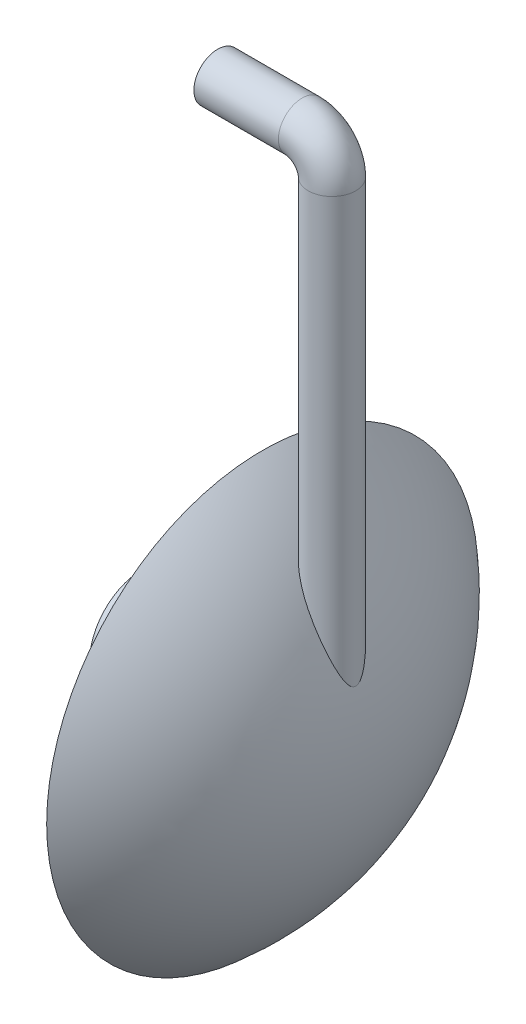
ISO-10303-21;
HEADER;
FILE_DESCRIPTION(('STEP AP214'),'2;1');
FILE_NAME('part.step','',(''),(''),'','','');
FILE_SCHEMA(('AUTOMOTIVE_DESIGN { 1 0 10303 214 1 1 1 1 }'));
ENDSEC;
DATA;
#1=APPLICATION_CONTEXT('core data for automotive mechanical design processes');
#2=APPLICATION_PROTOCOL_DEFINITION('international standard','automotive_design',2000,#1);
#3=PRODUCT_CONTEXT('',#1,'mechanical');
#4=PRODUCT('Part','Part','',(#3));
#5=PRODUCT_RELATED_PRODUCT_CATEGORY('part','',(#4));
#6=PRODUCT_DEFINITION_FORMATION('','',#4);
#7=PRODUCT_DEFINITION_CONTEXT('part definition',#1,'design');
#8=PRODUCT_DEFINITION('design','',#6,#7);
#9=PRODUCT_DEFINITION_SHAPE('','',#8);
#10=(LENGTH_UNIT() NAMED_UNIT(*) SI_UNIT(.MILLI.,.METRE.));
#11=(NAMED_UNIT(*) PLANE_ANGLE_UNIT() SI_UNIT($,.RADIAN.));
#12=(NAMED_UNIT(*) SI_UNIT($,.STERADIAN.) SOLID_ANGLE_UNIT());
#13=UNCERTAINTY_MEASURE_WITH_UNIT(LENGTH_MEASURE(1.E-05),#10,'distance_accuracy_value','');
#14=(GEOMETRIC_REPRESENTATION_CONTEXT(3) GLOBAL_UNCERTAINTY_ASSIGNED_CONTEXT((#13)) GLOBAL_UNIT_ASSIGNED_CONTEXT((#10,
#11,#12)) REPRESENTATION_CONTEXT('',''));
#15=CARTESIAN_POINT('',(0.,0.,0.));
#16=DIRECTION('',(0.,0.,1.));
#17=DIRECTION('',(1.,0.,0.));
#18=AXIS2_PLACEMENT_3D('',#15,#16,#17);
#19=CARTESIAN_POINT('',(-185.343786390025,0.,0.));
#20=DIRECTION('',(1.,0.,0.));
#21=DIRECTION('',(0.,0.,1.));
#22=AXIS2_PLACEMENT_3D('',#19,#20,#21);
#23=SPHERICAL_SURFACE('',#22,285.343786390025);
#24=CARTESIAN_POINT('',(0.,0.,0.));
#25=DIRECTION('',(1.,0.,0.));
#26=DIRECTION('',(0.,0.,-1.));
#27=AXIS2_PLACEMENT_3D('',#24,#25,#26);
#28=CIRCLE('',#27,216.953352769679);
#29=CARTESIAN_POINT('',(0.,0.,-216.953352769679));
#30=VERTEX_POINT('',#29);
#31=EDGE_CURVE('E61',#30,#30,#28,.T.);
#32=ORIENTED_EDGE('',*,*,#31,.T.);
#33=EDGE_LOOP('',(#32));
#34=FACE_BOUND('',#33,.T.);
#35=CARTESIAN_POINT('',(62.2636703985634,139.9998,22.6203398304166));
#36=CARTESIAN_POINT('',(61.9027263476033,140.658121206942,22.4968938305638));
#37=CARTESIAN_POINT('',(61.5406175922272,141.313921635277,22.3634070179453));
#38=CARTESIAN_POINT('',(60.8145731365812,142.619796144723,22.0751233894074));
#39=CARTESIAN_POINT('',(60.4506374883293,143.269870387443,21.9203271769609));
#40=CARTESIAN_POINT('',(59.7213577623748,144.563792849074,21.5879767054843));
#41=CARTESIAN_POINT('',(59.3560131343265,145.207638195836,21.4104124401147));
#42=CARTESIAN_POINT('',(58.6247792399603,146.487850025113,21.0310386957517));
#43=CARTESIAN_POINT('',(58.2588899784375,147.124216573039,20.8292294289841));
#44=CARTESIAN_POINT('',(57.5284368061105,148.386543108784,20.4002349878755));
#45=CARTESIAN_POINT('',(57.163872063309,149.012527343489,20.1731228269819));
#46=CARTESIAN_POINT('',(56.4360311013157,150.254559391187,19.6911113443718));
#47=CARTESIAN_POINT('',(56.0727549547583,150.870606650794,19.4362104812048));
#48=CARTESIAN_POINT('',(55.3490331106618,152.090548993624,18.8966485524759));
#49=CARTESIAN_POINT('',(54.9885854726526,152.694452952523,18.6120102407476));
#50=CARTESIAN_POINT('',(54.2718440424096,153.888357611285,18.0104020962776));
#51=CARTESIAN_POINT('',(53.9155494574985,154.478360987004,17.6934385497733));
#52=CARTESIAN_POINT('',(53.2445611383868,155.583304969259,17.0580556406698));
#53=CARTESIAN_POINT('',(52.9292905081036,156.099822477651,16.7429955457471));
#54=CARTESIAN_POINT('',(52.3053974392755,157.117054642396,16.0822288535739));
#55=CARTESIAN_POINT('',(51.996774544162,157.617770385124,15.7365243693854));
#56=CARTESIAN_POINT('',(51.3877776578471,158.601290994384,15.0113416115332));
#57=CARTESIAN_POINT('',(51.0874201598626,159.084060640729,14.6318014293539));
#58=CARTESIAN_POINT('',(50.4983222630698,160.026820369325,13.8369023309254));
#59=CARTESIAN_POINT('',(50.2095818934427,160.486810394355,13.4215433247102));
#60=CARTESIAN_POINT('',(49.6430081383043,161.385762524293,12.5458942118428));
#61=CARTESIAN_POINT('',(49.3654018795133,161.824308283958,12.085025996349));
#62=CARTESIAN_POINT('',(48.8302868123771,162.666478953893,11.1210472403951));
#63=CARTESIAN_POINT('',(48.5727829470182,163.070095277981,10.6179263731464));
#64=CARTESIAN_POINT('',(48.0846570544583,163.832642526297,9.5698118900984));
#65=CARTESIAN_POINT('',(47.8539370521912,164.191736662823,9.02498381725376));
#66=CARTESIAN_POINT('',(47.4253560196684,164.856899564422,7.89189096507701));
#67=CARTESIAN_POINT('',(47.2274632530662,165.163019555763,7.3036689421195));
#68=CARTESIAN_POINT('',(46.9477251911352,165.594782147632,6.34480856618702));
#69=CARTESIAN_POINT('',(46.8522574454987,165.741906022907,5.98769176866911));
#70=CARTESIAN_POINT('',(46.6763857518997,166.012634674426,5.26109821060694));
#71=CARTESIAN_POINT('',(46.5959766372437,166.136247517653,4.89162574082501));
#72=CARTESIAN_POINT('',(46.4517666780444,166.357744097707,4.1420817621577));
#73=CARTESIAN_POINT('',(46.3879564425447,166.455642383068,3.76201638165399));
#74=CARTESIAN_POINT('',(46.2782416340099,166.623860564999,2.99323893946723));
#75=CARTESIAN_POINT('',(46.2323375430637,166.694179719053,2.60452664528017));
#76=CARTESIAN_POINT('',(46.1593070405471,166.806011282779,1.81890848354996));
#77=CARTESIAN_POINT('',(46.1322899689683,166.84735595788,1.42196838359212));
#78=CARTESIAN_POINT('',(46.0981457573747,166.899602257516,0.625226792189353));
#79=CARTESIAN_POINT('',(46.091018463216,166.910504117979,0.225425322943854));
#80=CARTESIAN_POINT('',(46.0968388748351,166.901599655254,-0.573696849856603));
#81=CARTESIAN_POINT('',(46.1097871954694,166.881792391536,-0.973017538311811));
#82=CARTESIAN_POINT('',(46.1554252575168,166.811947486523,-1.7678467093707));
#83=CARTESIAN_POINT('',(46.1881145484165,166.761910535107,-2.16335527876239));
#84=CARTESIAN_POINT('',(46.2693506748254,166.637474377562,-2.91901388627132));
#85=CARTESIAN_POINT('',(46.3165734021,166.565108452891,-3.27964573032947));
#86=CARTESIAN_POINT('',(46.4263411877276,166.396749639285,-3.99291623349638));
#87=CARTESIAN_POINT('',(46.4888850345349,166.300758618544,-4.34555552222347));
#88=CARTESIAN_POINT('',(46.6281756557643,166.086749294119,-5.04125866998189));
#89=CARTESIAN_POINT('',(46.7049252693539,165.968726587137,-5.38432059907911));
#90=CARTESIAN_POINT('',(46.8713835260161,165.712431780668,-6.05959367673261));
#91=CARTESIAN_POINT('',(46.9610951977937,165.574154948511,-6.39180226700009));
#92=CARTESIAN_POINT('',(47.1966118595001,165.210623627223,-7.19610972506459));
#93=CARTESIAN_POINT('',(47.3491151479961,164.974803931419,-7.66150504807126));
#94=CARTESIAN_POINT('',(47.675308763602,164.469154927409,-8.56562762208775));
#95=CARTESIAN_POINT('',(47.8490076377835,164.199311897902,-9.00434400731707));
#96=CARTESIAN_POINT('',(48.2143841595208,163.63013469461,-9.85558015625186));
#97=CARTESIAN_POINT('',(48.4060963634344,163.330743779067,-10.2680469130206));
#98=CARTESIAN_POINT('',(48.8040931849174,162.707344997648,-11.0663009911573));
#99=CARTESIAN_POINT('',(49.0103778007832,162.383337134652,-11.4520883156444));
#100=CARTESIAN_POINT('',(49.5584191241633,161.519773139807,-12.4150488552601));
#101=CARTESIAN_POINT('',(49.9091824945431,160.964462402407,-12.9730205523554));
#102=CARTESIAN_POINT('',(50.6323729181717,159.813125716748,-14.0298205949206));
#103=CARTESIAN_POINT('',(51.004813010042,159.217075225014,-14.5286127840773));
#104=CARTESIAN_POINT('',(51.7657313753759,157.99204681174,-15.4728857502981));
#105=CARTESIAN_POINT('',(52.154235880807,157.363014545345,-15.9182742947841));
#106=CARTESIAN_POINT('',(52.9419923387504,156.079534317217,-16.759684553553));
#107=CARTESIAN_POINT('',(53.3412430478464,155.425089292085,-17.155711949686));
#108=CARTESIAN_POINT('',(54.0912269603407,154.187669718748,-17.8512031232611));
#109=CARTESIAN_POINT('',(54.4410226204185,153.607347921826,-18.1564445422492));
#110=CARTESIAN_POINT('',(55.1443518185261,152.433709886152,-18.7362760266065));
#111=CARTESIAN_POINT('',(55.4978858823838,151.840391806479,-19.0108617155669));
#112=CARTESIAN_POINT('',(56.2074285304726,150.642459054419,-19.53175166941));
#113=CARTESIAN_POINT('',(56.5634383878283,150.037838250898,-19.7780400344941));
#114=CARTESIAN_POINT('',(57.2765845925267,148.819212512366,-20.244177311825));
#115=CARTESIAN_POINT('',(57.6337208950701,148.20520794691,-20.4640272622691));
#116=CARTESIAN_POINT('',(58.348533926547,146.968494188952,-20.879293790349));
#117=CARTESIAN_POINT('',(58.7062108479702,146.345777359784,-21.0746872167181));
#118=CARTESIAN_POINT('',(59.4209918567909,145.093269399327,-21.4424036699371));
#119=CARTESIAN_POINT('',(59.7780959457422,144.463478287262,-21.614726759468));
#120=CARTESIAN_POINT('',(60.4910052624651,143.197843548346,-21.9377004043126));
#121=CARTESIAN_POINT('',(60.8468107645094,142.56200131579,-22.0883558292569));
#122=CARTESIAN_POINT('',(61.5566689397232,141.284849878801,-22.369317889194));
#123=CARTESIAN_POINT('',(61.9107215133293,140.64354036934,-22.4996233808963));
#124=CARTESIAN_POINT('',(62.9649337776355,138.720771887051,-22.860187663465));
#125=CARTESIAN_POINT('',(63.6618401808043,137.432147588998,-23.0621813097866));
#126=CARTESIAN_POINT('',(65.0439666539756,134.839765474641,-23.3981617761876));
#127=CARTESIAN_POINT('',(65.7291844683958,133.536004817212,-23.5321356105947));
#128=CARTESIAN_POINT('',(67.0862340992037,130.915388376321,-23.7384056265159));
#129=CARTESIAN_POINT('',(67.7580544595167,129.598522717299,-23.8106510620087));
#130=CARTESIAN_POINT('',(69.0859853693951,126.955186540181,-23.8984905608297));
#131=CARTESIAN_POINT('',(69.742096817663,125.628716577226,-23.9140878727119));
#132=CARTESIAN_POINT('',(71.0399596222494,122.962541262168,-23.8929270249512));
#133=CARTESIAN_POINT('',(71.6816415558885,121.622804001465,-23.8559552306917));
#134=CARTESIAN_POINT('',(72.9467850497911,118.937015080105,-23.7329084470534));
#135=CARTESIAN_POINT('',(73.5702463815941,117.590963340519,-23.6468328422604));
#136=CARTESIAN_POINT('',(74.7977498928706,114.894569633389,-23.4286269795393));
#137=CARTESIAN_POINT('',(75.4018013701018,113.544230071003,-23.296519142428));
#138=CARTESIAN_POINT('',(76.5900538351438,110.839823727039,-22.9886586980006));
#139=CARTESIAN_POINT('',(77.1742548310332,109.485756946977,-22.8129061084465));
#140=CARTESIAN_POINT('',(78.3627753388679,106.679131923491,-22.4057274520237));
#141=CARTESIAN_POINT('',(78.9655948544997,105.226381975027,-22.1712426573923));
#142=CARTESIAN_POINT('',(80.1470665542261,102.3192494564,-21.6560143051711));
#143=CARTESIAN_POINT('',(80.7257182616544,100.864866854615,-21.3752698357324));
#144=CARTESIAN_POINT('',(81.8586261264443,97.9548967970583,-20.7681717404017));
#145=CARTESIAN_POINT('',(82.4128653467668,96.4993091969782,-20.4417870855429));
#146=CARTESIAN_POINT('',(83.2251245671331,94.3171198513427,-19.9180906000943));
#147=CARTESIAN_POINT('',(83.4926908292437,93.5899320558294,-19.7378412304462));
#148=CARTESIAN_POINT('',(84.0214096559232,92.1361244538796,-19.3658229645488));
#149=CARTESIAN_POINT('',(84.2825618351224,91.4095046840981,-19.1740533785179));
#150=CARTESIAN_POINT('',(85.0532090080037,89.2395289636439,-18.5835732505331));
#151=CARTESIAN_POINT('',(85.5531228750231,87.7973814696918,-18.1676137140218));
#152=CARTESIAN_POINT('',(86.2831699002188,85.6387891033205,-17.5070394980842));
#153=CARTESIAN_POINT('',(86.5232161912483,84.9200259171355,-17.2807409506979));
#154=CARTESIAN_POINT('',(86.9966131671985,83.484445117633,-16.815348542997));
#155=CARTESIAN_POINT('',(87.2299640273289,82.7676274538493,-16.5762550179783));
#156=CARTESIAN_POINT('',(87.6896212447517,81.3371865064927,-16.0848050311613));
#157=CARTESIAN_POINT('',(87.9159346375585,80.623560686063,-15.8324625409372));
#158=CARTESIAN_POINT('',(88.361632294458,79.1994077786497,-15.3133303768516));
#159=CARTESIAN_POINT('',(88.5810166545839,78.4888806488374,-15.046540903358));
#160=CARTESIAN_POINT('',(89.0126327693542,77.0719347969192,-14.4973214368022));
#161=CARTESIAN_POINT('',(89.2248663980621,76.3655150391491,-14.214895593822));
#162=CARTESIAN_POINT('',(89.6420167758453,74.9577085435463,-13.6326836790159));
#163=CARTESIAN_POINT('',(89.846934014982,74.2563214711418,-13.3328987734629));
#164=CARTESIAN_POINT('',(90.1267577874575,73.284966033922,-12.9021325310698));
#165=CARTESIAN_POINT('',(90.2048882304192,73.0122275409681,-12.7794566788186));
#166=CARTESIAN_POINT('',(90.3599601221606,72.4678692554283,-12.5309237434637));
#167=CARTESIAN_POINT('',(90.4369015880638,72.1962494467728,-12.4050667062439));
#168=CARTESIAN_POINT('',(90.6659121497875,71.3832318427875,-12.0224413728677));
#169=CARTESIAN_POINT('',(90.8161652430444,70.8436833924406,-11.7606221783163));
#170=CARTESIAN_POINT('',(91.1120494528621,69.7690829891764,-11.2208288757854));
#171=CARTESIAN_POINT('',(91.2576638681057,69.2340514816725,-10.9428047902982));
#172=CARTESIAN_POINT('',(91.5433826177528,68.1721396817153,-10.3689923813664));
#173=CARTESIAN_POINT('',(91.6834875912082,67.6452584482204,-10.0732061283116));
#174=CARTESIAN_POINT('',(91.9610706349559,66.5893108997721,-9.45305537113048));
#175=CARTESIAN_POINT('',(92.0983982441994,66.060512307755,-9.12816529436819));
#176=CARTESIAN_POINT('',(92.3660012638125,65.0179143475384,-8.45135278290164));
#177=CARTESIAN_POINT('',(92.4962720891855,64.5041248287087,-8.09941312407834));
#178=CARTESIAN_POINT('',(92.6849316371785,63.7514449346592,-7.54730606780771));
#179=CARTESIAN_POINT('',(92.746553892952,63.5041242817743,-7.35971621851399));
#180=CARTESIAN_POINT('',(92.867408834903,63.0163034519463,-6.97516024551367));
#181=CARTESIAN_POINT('',(92.9266418677921,62.7758022869102,-6.7781954913535));
#182=CARTESIAN_POINT('',(93.0423203384712,62.3034965199439,-6.37386870910625));
#183=CARTESIAN_POINT('',(93.0987690691745,62.0716817268945,-6.16651957743111));
#184=CARTESIAN_POINT('',(93.2084881682589,61.618677045815,-5.73978993240589));
#185=CARTESIAN_POINT('',(93.2617596498377,61.397483441847,-5.5204136852576));
#186=CARTESIAN_POINT('',(93.347278799531,61.0405750598909,-5.14382062447647));
#187=CARTESIAN_POINT('',(93.3805847330466,60.9010753509645,-4.99043643138807));
#188=CARTESIAN_POINT('',(93.4452781960762,60.629224942591,-4.67707824111384));
#189=CARTESIAN_POINT('',(93.4766657205057,60.496874262092,-4.51710422646392));
#190=CARTESIAN_POINT('',(93.5676145313459,60.112179969282,-4.02608664547797));
#191=CARTESIAN_POINT('',(93.6238924295332,59.8724852967844,-3.68424722051363));
#192=CARTESIAN_POINT('',(93.7251954577838,59.4388927688728,-2.96302008740866));
#193=CARTESIAN_POINT('',(93.7700468705826,59.2457041218997,-2.58316255141895));
#194=CARTESIAN_POINT('',(93.8244651838158,59.0105461487762,-1.9911317205688));
#195=CARTESIAN_POINT('',(93.8404506087175,58.9413120426774,-1.79032116459985));
#196=CARTESIAN_POINT('',(93.8675774236423,58.8236758732176,-1.3824284676455));
#197=CARTESIAN_POINT('',(93.8787213298679,58.7752629889202,-1.17534964436713));
#198=CARTESIAN_POINT('',(93.8994545953766,58.6851367636802,-0.662264972243405));
#199=CARTESIAN_POINT('',(93.9060801303659,58.6562749691765,-0.353733127146157));
#200=CARTESIAN_POINT('',(93.9072462052157,58.6511984027582,0.263712557983289));
#201=CARTESIAN_POINT('',(93.9017872092943,58.6749816085255,0.572626382886423));
#202=CARTESIAN_POINT('',(93.8794688860112,58.7720237037015,1.18061211147604));
#203=CARTESIAN_POINT('',(93.8626571388684,58.8450761006886,1.47971964996072));
#204=CARTESIAN_POINT('',(93.8192823466902,59.0329904429555,2.06357349196985));
#205=CARTESIAN_POINT('',(93.7927114879452,59.1478858895787,2.34830807931918));
#206=CARTESIAN_POINT('',(93.7105981688641,59.5015728718353,3.09181867465144));
#207=CARTESIAN_POINT('',(93.6477165656401,59.7711470401314,3.53509620675101));
#208=CARTESIAN_POINT('',(93.5420543158047,60.2203046911103,4.1650743201037));
#209=CARTESIAN_POINT('',(93.504852740357,60.3778713224286,4.36963971508009));
#210=CARTESIAN_POINT('',(93.4272489044372,60.7051758222815,4.76819997734427));
#211=CARTESIAN_POINT('',(93.3868473381836,60.8749110501598,4.96219712201969));
#212=CARTESIAN_POINT('',(93.2899483966688,61.2801975749676,5.40134186111938));
#213=CARTESIAN_POINT('',(93.2324503973366,61.5193724944327,5.64289588719687));
#214=CARTESIAN_POINT('',(93.1136008634971,62.0107112992659,6.1114995265453));
#215=CARTESIAN_POINT('',(93.0522477385267,62.2628805377235,6.33854307444485));
#216=CARTESIAN_POINT('',(92.9262062004661,62.7776583698134,6.78030033747008));
#217=CARTESIAN_POINT('',(92.8615126356788,63.0402829358541,6.99499385881072));
#218=CARTESIAN_POINT('',(92.7293073715444,63.5735237108589,7.4133165929632));
#219=CARTESIAN_POINT('',(92.6617953520541,63.8441408266553,7.61694454277712));
#220=CARTESIAN_POINT('',(92.5239209183178,64.3932130289597,8.01550009058109));
#221=CARTESIAN_POINT('',(92.4535455089122,64.6717015522289,8.2103769475318));
#222=CARTESIAN_POINT('',(92.3105163664178,65.233980543888,8.5914397225809));
#223=CARTESIAN_POINT('',(92.2378625819226,65.5177711318483,8.77762544434749));
#224=CARTESIAN_POINT('',(92.0905362068164,66.0894539335299,9.14206595509149));
#225=CARTESIAN_POINT('',(92.0158657155109,66.3773417449056,9.32032851621266));
#226=CARTESIAN_POINT('',(91.8645789491961,66.956790786822,9.66990199949357));
#227=CARTESIAN_POINT('',(91.7879626758887,67.2483520141497,9.84121292773325));
#228=CARTESIAN_POINT('',(91.5757959988562,68.0504565190723,10.3014140578612));
#229=CARTESIAN_POINT('',(91.4383961944638,68.5641417263081,10.5839856976622));
#230=CARTESIAN_POINT('',(91.1584962323354,69.5987304640031,11.1329900265338));
#231=CARTESIAN_POINT('',(91.0159954364628,70.1196348925597,11.399420685056));
#232=CARTESIAN_POINT('',(90.7261477312257,71.1673032892379,11.918292812518));
#233=CARTESIAN_POINT('',(90.5787988294643,71.6940696060152,12.1707284126185));
#234=CARTESIAN_POINT('',(90.2795274203375,72.7521402227894,12.6631084850649));
#235=CARTESIAN_POINT('',(90.1276046792848,73.2834447536567,12.903052317464));
#236=CARTESIAN_POINT('',(89.819055802177,74.3507663622142,13.3721564480157));
#237=CARTESIAN_POINT('',(89.6624209924768,74.8867906601208,13.6012945783968));
#238=CARTESIAN_POINT('',(89.3448614376557,75.9618675528453,14.0492785874371));
#239=CARTESIAN_POINT('',(89.1839365669482,76.5009202359503,14.2681241642742));
#240=CARTESIAN_POINT('',(88.6949717175001,78.1215298829432,14.910349523127));
#241=CARTESIAN_POINT('',(88.3606550525098,79.2068376858999,15.3195482036767));
#242=CARTESIAN_POINT('',(87.675266615984,81.3864116159687,16.1055154937113));
#243=CARTESIAN_POINT('',(87.3241633550197,82.4806911118761,16.4822191142907));
#244=CARTESIAN_POINT('',(86.6062225086973,84.6741283049196,17.2053333970209));
#245=CARTESIAN_POINT('',(86.239384233708,85.7732862139692,17.5517427294132));
#246=CARTESIAN_POINT('',(85.4907457382116,87.9737147305728,18.2158561746517));
#247=CARTESIAN_POINT('',(85.1089622255378,89.0749817398199,18.5335910998381));
#248=CARTESIAN_POINT('',(84.330349496553,91.2796831827372,19.1419872544378));
#249=CARTESIAN_POINT('',(83.9335199204006,92.3831176676455,19.432647835766));
#250=CARTESIAN_POINT('',(82.9535166829483,95.0598198199715,20.1053464265812));
#251=CARTESIAN_POINT('',(82.3627348449652,96.6337356202198,20.4738113931539));
#252=CARTESIAN_POINT('',(81.1519180536867,99.7819063935222,21.1577076528501));
#253=CARTESIAN_POINT('',(80.5318815343303,101.356161380233,21.4731361026895));
#254=CARTESIAN_POINT('',(79.2628374828174,104.504355569139,22.0503216907508));
#255=CARTESIAN_POINT('',(78.6138072129983,106.078293515468,22.3120357719985));
#256=CARTESIAN_POINT('',(77.288113337478,109.222798069603,22.7795510463375));
#257=CARTESIAN_POINT('',(76.6114505776928,110.793364779066,22.9853539495689));
#258=CARTESIAN_POINT('',(75.2351573306658,113.921022050943,23.3372126303157));
#259=CARTESIAN_POINT('',(74.5356691819328,115.478139746892,23.4835823422445));
#260=CARTESIAN_POINT('',(73.1114333372859,118.585582358838,23.7143424219881));
#261=CARTESIAN_POINT('',(72.386684025424,120.135906833106,23.7987288171015));
#262=CARTESIAN_POINT('',(70.9141164349178,123.22602713752,23.9006107560571));
#263=CARTESIAN_POINT('',(70.1663205210488,124.765831507048,23.9181692107792));
#264=CARTESIAN_POINT('',(68.6489351116376,127.833564584555,23.8805615225812));
#265=CARTESIAN_POINT('',(67.8793502950386,129.361495753704,23.8254108790149));
#266=CARTESIAN_POINT('',(66.706290340909,131.650081154146,23.6820438822729));
#267=CARTESIAN_POINT('',(66.3100340665188,132.416390345752,23.6236807835395));
#268=CARTESIAN_POINT('',(65.5129512818093,133.944616531777,23.4853280190208));
#269=CARTESIAN_POINT('',(65.1121251513331,134.70653388343,23.4053401382989));
#270=CARTESIAN_POINT('',(64.3054497685619,136.227060220464,23.2222757043694));
#271=CARTESIAN_POINT('',(63.8995915281332,136.985658488351,23.119149595558));
#272=CARTESIAN_POINT('',(63.084215817873,138.497194192605,22.888469423222));
#273=CARTESIAN_POINT('',(62.6746982848198,139.250131530753,22.760914936867));
#274=CARTESIAN_POINT('',(62.2636703985634,139.9998,22.6203398304166));
#275=B_SPLINE_CURVE_WITH_KNOTS('',3,(#35,#36,#37,#38,#39,#40,#41,#42,#43,#44,#45,#46,#47,#48,
#49,#50,#51,#52,#53,#54,#55,#56,#57,#58,#59,#60,#61,#62,#63,#64,#65,#66,#67,#68,#69,#70,#71,#72,
#73,#74,#75,#76,#77,#78,#79,#80,#81,#82,#83,#84,#85,#86,#87,#88,#89,#90,#91,#92,#93,#94,#95,#96,
#97,#98,#99,#100,#101,#102,#103,#104,#105,#106,#107,#108,#109,#110,#111,#112,#113,#114,#115,
#116,#117,#118,#119,#120,#121,#122,#123,#124,#125,#126,#127,#128,#129,#130,#131,#132,#133,#134,
#135,#136,#137,#138,#139,#140,#141,#142,#143,#144,#145,#146,#147,#148,#149,#150,#151,#152,#153,
#154,#155,#156,#157,#158,#159,#160,#161,#162,#163,#164,#165,#166,#167,#168,#169,#170,#171,#172,
#173,#174,#175,#176,#177,#178,#179,#180,#181,#182,#183,#184,#185,#186,#187,#188,#189,#190,#191,
#192,#193,#194,#195,#196,#197,#198,#199,#200,#201,#202,#203,#204,#205,#206,#207,#208,#209,#210,
#211,#212,#213,#214,#215,#216,#217,#218,#219,#220,#221,#222,#223,#224,#225,#226,#227,#228,#229,
#230,#231,#232,#233,#234,#235,#236,#237,#238,#239,#240,#241,#242,#243,#244,#245,#246,#247,#248,
#249,#250,#251,#252,#253,#254,#255,#256,#257,#258,#259,#260,#261,#262,#263,#264,#265,#266,#267,
#268,#269,#270,#271,#272,#273,#274),.UNSPECIFIED.,.T.,.F.,(4,2,2,2,2,2,2,2,2,2,2,2,2,2,2,2,2,2,
2,2,2,2,2,2,2,2,2,2,2,2,2,2,2,2,2,2,2,2,2,2,2,2,2,2,2,2,2,2,2,2,2,2,2,2,2,2,2,2,2,2,2,2,2,2,2,2,
2,2,2,2,2,2,2,2,2,2,2,2,2,2,2,2,2,2,2,2,2,2,2,2,2,2,2,2,2,2,2,2,2,2,2,2,2,2,2,2,2,2,2,2,2,2,2,2,
2,2,2,2,2,4),(0.,2.28249636996076,4.56492811391945,6.84836642500853,9.13178474975585,
11.4087768809891,13.68589538222,15.9612841156464,18.2362311985532,20.2821433337398,
22.3279145040939,24.3775087738741,26.4271081917581,28.507300131545,30.5880019699912,
32.6608353311892,34.7316529130466,35.92423160334,37.1164003611064,38.3078931651207,
39.4994180456102,40.6977849750746,41.8961426172784,43.0945369623408,44.2929039595983,
45.4042373455856,46.5154828791839,47.6269507468179,48.7386787404733,50.366838450326,
51.9956568951029,53.627666434533,55.2596757831548,57.8409612369914,60.4238157194381,
63.0110686453962,65.5980234829584,67.8267396373982,70.0557735573671,72.286053872167,
74.5162465785471,76.7485347358863,78.9808168280886,81.2125964465355,83.4445014047277,
87.879005317983,92.314355505,96.7533484304512,101.192086792569,105.648915302719,110.10579967118,
114.56051626234,119.015231040559,123.785054684027,128.554972359254,133.328148824522,
135.714671516398,138.101337245779,142.846222121654,145.218690233146,147.591096203875,
149.961048749967,152.330968435145,154.7002621025,157.069396772551,157.996666197418,
158.923922255432,160.778459879822,162.639055492553,164.499434650345,166.405784634678,
168.313358728719,169.262602231793,170.211707486353,171.159661937845,172.10728228402,
172.737042146498,173.366803678049,174.627591661997,175.906535739038,176.544561162352,
177.182254597459,178.107330231598,179.032370330268,179.953557383166,180.875483605312,
182.433643858895,183.216043374515,183.998273615826,185.031846848417,186.065849325864,
187.101497084256,188.137262801802,189.178413841405,190.219588389126,191.259717988131,
192.299846677412,194.105961639914,195.912303343336,197.719396895361,199.526582932958,
201.337328050197,203.14812623324,206.768710333264,210.396375244476,214.024199311079,
217.648077457449,221.272042327177,226.43404560743,231.596325534144,236.762727475994,
241.928971376699,247.067559902353,252.206477747211,257.340556689053,262.473541379374,
265.067312568368,267.660869714367,270.260035473932,272.859246226506),.UNSPECIFIED.);
#276=CARTESIAN_POINT('',(62.2636703985634,139.9998,22.6203398304166));
#277=VERTEX_POINT('',#276);
#278=EDGE_CURVE('E10',#277,#277,#275,.T.);
#279=ORIENTED_EDGE('',*,*,#278,.T.);
#280=EDGE_LOOP('',(#279));
#281=FACE_BOUND('',#280,.T.);
#282=ADVANCED_FACE('F42',(#34,#281),#23,.T.);
#283=CARTESIAN_POINT('',(0.,0.,0.));
#284=DIRECTION('',(1.,0.,0.));
#285=DIRECTION('',(0.,0.,-1.));
#286=AXIS2_PLACEMENT_3D('',#283,#284,#285);
#287=PLANE('',#286);
#288=CARTESIAN_POINT('',(0.,0.,0.));
#289=DIRECTION('',(1.,0.,0.));
#290=DIRECTION('',(0.,0.,-1.));
#291=AXIS2_PLACEMENT_3D('',#288,#289,#290);
#292=CIRCLE('',#291,128.579446045451);
#293=CARTESIAN_POINT('',(0.,0.,-128.579446045451));
#294=VERTEX_POINT('',#293);
#295=EDGE_CURVE('E68',#294,#294,#292,.T.);
#296=ORIENTED_EDGE('',*,*,#295,.T.);
#297=EDGE_LOOP('',(#296));
#298=FACE_BOUND('',#297,.T.);
#299=ORIENTED_EDGE('',*,*,#31,.F.);
#300=EDGE_LOOP('',(#299));
#301=FACE_BOUND('',#300,.T.);
#302=ADVANCED_FACE('F44',(#298,#301),#287,.F.);
#303=CARTESIAN_POINT('',(-185.343786390025,0.,0.));
#304=DIRECTION('',(1.,0.,0.));
#305=DIRECTION('',(0.,0.,1.));
#306=AXIS2_PLACEMENT_3D('',#303,#304,#305);
#307=SPHERICAL_SURFACE('',#306,225.577022541628);
#308=CARTESIAN_POINT('',(33.7261101941686,0.,0.));
#309=DIRECTION('',(-1.,0.,0.));
#310=DIRECTION('',(0.,0.,1.));
#311=AXIS2_PLACEMENT_3D('',#308,#309,#310);
#312=CIRCLE('',#311,53.7900874635569);
#313=CARTESIAN_POINT('',(33.7261101941686,0.,53.7900874635569));
#314=VERTEX_POINT('',#313);
#315=EDGE_CURVE('E54',#314,#314,#312,.T.);
#316=ORIENTED_EDGE('',*,*,#315,.F.);
#317=EDGE_LOOP('',(#316));
#318=FACE_BOUND('',#317,.T.);
#319=ORIENTED_EDGE('',*,*,#295,.F.);
#320=EDGE_LOOP('',(#319));
#321=FACE_BOUND('',#320,.T.);
#322=ADVANCED_FACE('F120',(#318,#321),#307,.F.);
#323=CARTESIAN_POINT('',(100.002,0.,0.));
#324=DIRECTION('',(-1.,0.,0.));
#325=DIRECTION('',(0.,0.,1.));
#326=AXIS2_PLACEMENT_3D('',#323,#324,#325);
#327=CYLINDRICAL_SURFACE('',#326,53.7900874635569);
#328=ORIENTED_EDGE('',*,*,#315,.T.);
#329=EDGE_LOOP('',(#328));
#330=FACE_BOUND('',#329,.T.);
#331=CARTESIAN_POINT('',(-120.,0.,0.));
#332=DIRECTION('',(-1.,0.,0.));
#333=DIRECTION('',(0.,0.,1.));
#334=AXIS2_PLACEMENT_3D('',#331,#332,#333);
#335=CIRCLE('',#334,53.7900874635569);
#336=CARTESIAN_POINT('',(-120.,0.,53.7900874635569));
#337=VERTEX_POINT('',#336);
#338=EDGE_CURVE('E74',#337,#337,#335,.T.);
#339=ORIENTED_EDGE('',*,*,#338,.F.);
#340=EDGE_LOOP('',(#339));
#341=FACE_BOUND('',#340,.T.);
#342=ADVANCED_FACE('F107',(#330,#341),#327,.T.);
#343=CARTESIAN_POINT('',(-120.,0.,0.));
#344=DIRECTION('',(-1.,0.,0.));
#345=DIRECTION('',(0.,0.,1.));
#346=AXIS2_PLACEMENT_3D('',#343,#344,#345);
#347=PLANE('',#346);
#348=ORIENTED_EDGE('',*,*,#338,.T.);
#349=EDGE_LOOP('',(#348));
#350=FACE_BOUND('',#349,.T.);
#351=ADVANCED_FACE('F99',(#350),#347,.T.);
#352=CARTESIAN_POINT('',(70.,140.,0.));
#353=DIRECTION('',(0.,1.,0.));
#354=DIRECTION('',(-1.,0.,0.));
#355=AXIS2_PLACEMENT_3D('',#352,#353,#354);
#356=CYLINDRICAL_SURFACE('',#355,23.9067055393586);
#357=CARTESIAN_POINT('',(70.,490.,0.));
#358=DIRECTION('',(0.,1.,0.));
#359=DIRECTION('',(0.,0.,1.));
#360=AXIS2_PLACEMENT_3D('',#357,#358,#359);
#361=CIRCLE('',#360,23.9067055393586);
#362=CARTESIAN_POINT('',(93.9067055393586,490.,0.));
#363=VERTEX_POINT('',#362);
#364=EDGE_CURVE('E86',#363,#363,#361,.T.);
#365=ORIENTED_EDGE('',*,*,#364,.F.);
#366=EDGE_LOOP('',(#365));
#367=FACE_BOUND('',#366,.T.);
#368=ORIENTED_EDGE('',*,*,#278,.F.);
#369=EDGE_LOOP('',(#368));
#370=FACE_BOUND('',#369,.T.);
#371=ADVANCED_FACE('F95',(#367,#370),#356,.T.);
#372=CARTESIAN_POINT('',(-45.,520.,0.));
#373=DIRECTION('',(-1.,0.,0.));
#374=DIRECTION('',(0.,0.,1.));
#375=AXIS2_PLACEMENT_3D('',#372,#373,#374);
#376=PLANE('',#375);
#377=CARTESIAN_POINT('',(-45.,520.,0.));
#378=DIRECTION('',(-1.,0.,0.));
#379=DIRECTION('',(0.,0.,1.));
#380=AXIS2_PLACEMENT_3D('',#377,#378,#379);
#381=CIRCLE('',#380,23.9067055393586);
#382=CARTESIAN_POINT('',(-45.,520.,23.9067055393586));
#383=VERTEX_POINT('',#382);
#384=EDGE_CURVE('E78',#383,#383,#381,.T.);
#385=ORIENTED_EDGE('',*,*,#384,.T.);
#386=EDGE_LOOP('',(#385));
#387=FACE_BOUND('',#386,.T.);
#388=ADVANCED_FACE('F98',(#387),#376,.T.);
#389=CARTESIAN_POINT('',(40.,490.,0.));
#390=DIRECTION('',(0.,0.,1.));
#391=DIRECTION('',(1.,0.,0.));
#392=AXIS2_PLACEMENT_3D('',#389,#390,#391);
#393=TOROIDAL_SURFACE('',#392,30.,23.9067055393586);
#394=CARTESIAN_POINT('',(40.,520.,0.));
#395=DIRECTION('',(-1.,0.,0.));
#396=DIRECTION('',(0.,0.,1.));
#397=AXIS2_PLACEMENT_3D('',#394,#395,#396);
#398=CIRCLE('',#397,23.9067055393586);
#399=CARTESIAN_POINT('',(40.,543.906705539359,0.));
#400=VERTEX_POINT('',#399);
#401=EDGE_CURVE('E82',#400,#400,#398,.T.);
#402=CARTESIAN_POINT('',(40.,490.,0.));
#403=DIRECTION('',(0.,0.,1.));
#404=DIRECTION('',(1.,0.,0.));
#405=AXIS2_PLACEMENT_3D('',#402,#403,#404);
#406=CIRCLE('',#405,53.9067055393586);
#407=EDGE_CURVE('',#363,#400,#406,.T.);
#408=ORIENTED_EDGE('',*,*,#364,.T.);
#409=ORIENTED_EDGE('',*,*,#401,.F.);
#410=ORIENTED_EDGE('',*,*,#407,.T.);
#411=ORIENTED_EDGE('',*,*,#407,.F.);
#412=EDGE_LOOP('',(#408,#410,#409,#411));
#413=FACE_BOUND('',#412,.T.);
#414=ADVANCED_FACE('F93',(#413),#393,.T.);
#415=CARTESIAN_POINT('',(40.,520.,0.));
#416=DIRECTION('',(-1.,0.,0.));
#417=DIRECTION('',(0.,-1.,0.));
#418=AXIS2_PLACEMENT_3D('',#415,#416,#417);
#419=CYLINDRICAL_SURFACE('',#418,23.9067055393586);
#420=ORIENTED_EDGE('',*,*,#384,.F.);
#421=EDGE_LOOP('',(#420));
#422=FACE_BOUND('',#421,.T.);
#423=ORIENTED_EDGE('',*,*,#401,.T.);
#424=EDGE_LOOP('',(#423));
#425=FACE_BOUND('',#424,.T.);
#426=ADVANCED_FACE('F100',(#422,#425),#419,.T.);
#427=CLOSED_SHELL('',(#282,#302,#322,#342,#351,#371,#388,#414,#426));
#428=MANIFOLD_SOLID_BREP('B2',#427);
#429=ADVANCED_BREP_SHAPE_REPRESENTATION('',(#18,#428),#14);
#430=SHAPE_DEFINITION_REPRESENTATION(#9,#429);
ENDSEC;
END-ISO-10303-21;
